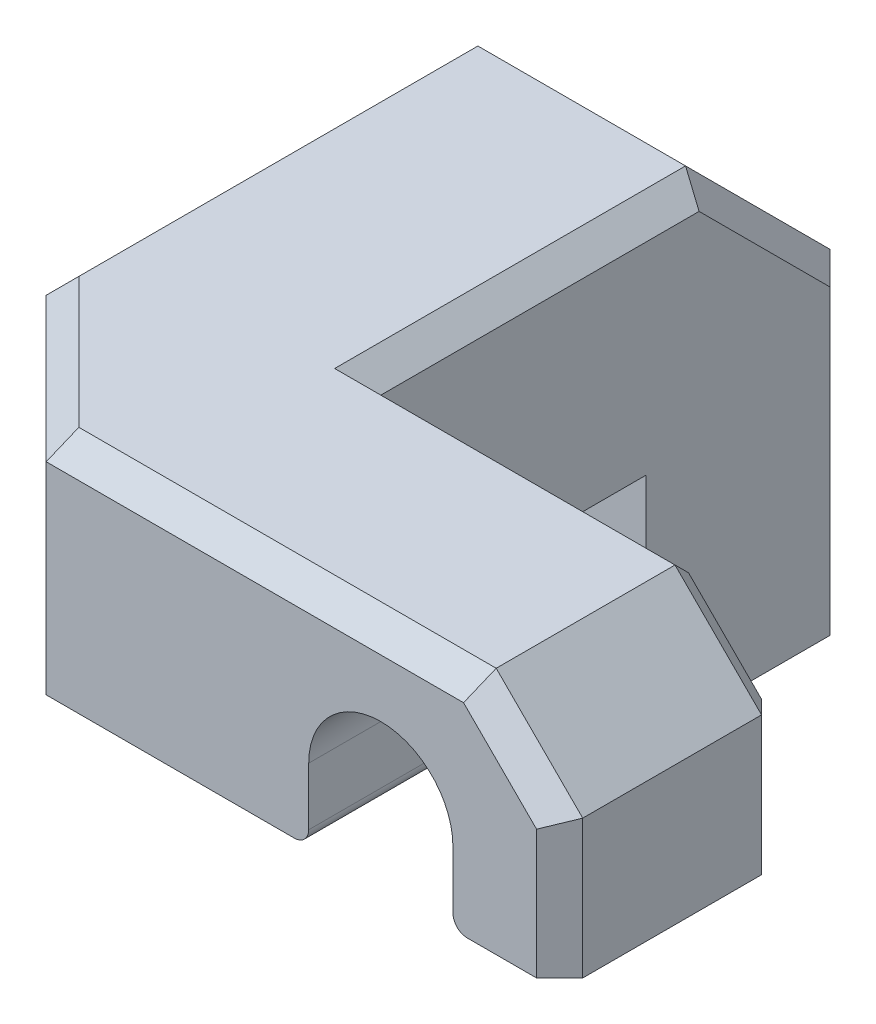
ISO-10303-21;
HEADER;
FILE_DESCRIPTION(('STEP AP214'),'2;1');
FILE_NAME('part.step','',(''),(''),'','','');
FILE_SCHEMA(('AUTOMOTIVE_DESIGN { 1 0 10303 214 1 1 1 1 }'));
ENDSEC;
DATA;
#1=APPLICATION_CONTEXT('core data for automotive mechanical design processes');
#2=APPLICATION_PROTOCOL_DEFINITION('international standard','automotive_design',2000,#1);
#3=PRODUCT_CONTEXT('',#1,'mechanical');
#4=PRODUCT('Part','Part','',(#3));
#5=PRODUCT_RELATED_PRODUCT_CATEGORY('part','',(#4));
#6=PRODUCT_DEFINITION_FORMATION('','',#4);
#7=PRODUCT_DEFINITION_CONTEXT('part definition',#1,'design');
#8=PRODUCT_DEFINITION('design','',#6,#7);
#9=PRODUCT_DEFINITION_SHAPE('','',#8);
#10=(LENGTH_UNIT() NAMED_UNIT(*) SI_UNIT(.MILLI.,.METRE.));
#11=(NAMED_UNIT(*) PLANE_ANGLE_UNIT() SI_UNIT($,.RADIAN.));
#12=(NAMED_UNIT(*) SI_UNIT($,.STERADIAN.) SOLID_ANGLE_UNIT());
#13=UNCERTAINTY_MEASURE_WITH_UNIT(LENGTH_MEASURE(1.E-05),#10,'distance_accuracy_value','');
#14=(GEOMETRIC_REPRESENTATION_CONTEXT(3) GLOBAL_UNCERTAINTY_ASSIGNED_CONTEXT((#13)) GLOBAL_UNIT_ASSIGNED_CONTEXT((#10,
#11,#12)) REPRESENTATION_CONTEXT('',''));
#15=CARTESIAN_POINT('',(0.,0.,0.));
#16=DIRECTION('',(0.,0.,1.));
#17=DIRECTION('',(1.,0.,0.));
#18=AXIS2_PLACEMENT_3D('',#15,#16,#17);
#19=CARTESIAN_POINT('',(5.588,5.5881,21.591));
#20=DIRECTION('',(0.,0.,-1.));
#21=DIRECTION('',(-1.,0.,0.));
#22=AXIS2_PLACEMENT_3D('',#19,#20,#21);
#23=CYLINDRICAL_SURFACE('',#22,1.778);
#24=CARTESIAN_POINT('',(5.588,5.5881,0.));
#25=DIRECTION('',(0.,0.,1.));
#26=DIRECTION('',(1.,0.,0.));
#27=AXIS2_PLACEMENT_3D('',#24,#25,#26);
#28=CIRCLE('',#27,1.778);
#29=CARTESIAN_POINT('',(7.366,5.5881,0.));
#30=VERTEX_POINT('',#29);
#31=EDGE_CURVE('E242',#30,#30,#28,.F.);
#32=ORIENTED_EDGE('',*,*,#31,.F.);
#33=EDGE_LOOP('',(#32));
#34=FACE_BOUND('',#33,.T.);
#35=CARTESIAN_POINT('',(5.588,5.5881,-5.54376957895253));
#36=DIRECTION('',(0.,0.,-1.));
#37=DIRECTION('',(-1.,0.,0.));
#38=AXIS2_PLACEMENT_3D('',#35,#36,#37);
#39=CIRCLE('',#38,1.778);
#40=CARTESIAN_POINT('',(3.81,5.5881,-5.54376957895253));
#41=VERTEX_POINT('',#40);
#42=EDGE_CURVE('E246',#41,#41,#39,.F.);
#43=ORIENTED_EDGE('',*,*,#42,.F.);
#44=EDGE_LOOP('',(#43));
#45=FACE_BOUND('',#44,.T.);
#46=ADVANCED_FACE('F37',(#34,#45),#23,.F.);
#47=CARTESIAN_POINT('',(11.176,0.,21.59));
#48=DIRECTION('',(0.,0.,1.));
#49=DIRECTION('',(1.,0.,0.));
#50=AXIS2_PLACEMENT_3D('',#47,#48,#49);
#51=PLANE('',#50);
#52=DIRECTION('',(-1.,0.,0.));
#53=VECTOR('',#52,1.);
#54=CARTESIAN_POINT('',(11.176,11.176,21.59));
#55=LINE('',#54,#53);
#56=CARTESIAN_POINT('',(27.94,11.176,21.59));
#57=VERTEX_POINT('',#56);
#58=CARTESIAN_POINT('',(24.892,11.176,21.59));
#59=VERTEX_POINT('',#58);
#60=EDGE_CURVE('E538',#57,#59,#55,.T.);
#61=ORIENTED_EDGE('',*,*,#60,.F.);
#62=DIRECTION('',(0.,1.,0.));
#63=VECTOR('',#62,1.);
#64=CARTESIAN_POINT('',(27.94,0.,21.59));
#65=LINE('',#64,#63);
#66=CARTESIAN_POINT('',(27.94,16.8511590206289,21.59));
#67=VERTEX_POINT('',#66);
#68=EDGE_CURVE('E333',#57,#67,#65,.T.);
#69=ORIENTED_EDGE('',*,*,#68,.T.);
#70=DIRECTION('',(-0.707106781186549,0.707106781186546,0.));
#71=VECTOR('',#70,1.);
#72=CARTESIAN_POINT('',(27.9835795103144,16.8075795103145,21.59));
#73=LINE('',#72,#71);
#74=CARTESIAN_POINT('',(24.7251590206289,20.066,21.59));
#75=VERTEX_POINT('',#74);
#76=EDGE_CURVE('E331',#67,#75,#73,.T.);
#77=ORIENTED_EDGE('',*,*,#76,.T.);
#78=DIRECTION('',(-1.,0.,0.));
#79=VECTOR('',#78,1.);
#80=CARTESIAN_POINT('',(11.176,20.066,21.59));
#81=LINE('',#80,#79);
#82=CARTESIAN_POINT('',(6.35000000000002,20.066,21.59));
#83=VERTEX_POINT('',#82);
#84=EDGE_CURVE('E326',#75,#83,#81,.T.);
#85=ORIENTED_EDGE('',*,*,#84,.T.);
#86=DIRECTION('',(0.,-1.,0.));
#87=VECTOR('',#86,1.);
#88=CARTESIAN_POINT('',(6.35000000000002,11.176,21.59));
#89=LINE('',#88,#87);
#90=CARTESIAN_POINT('',(6.35000000000002,11.176,21.59));
#91=VERTEX_POINT('',#90);
#92=EDGE_CURVE('E304',#83,#91,#89,.T.);
#93=ORIENTED_EDGE('',*,*,#92,.T.);
#94=CARTESIAN_POINT('',(17.272,11.176,21.59));
#95=VERTEX_POINT('',#94);
#96=EDGE_CURVE('E533',#95,#91,#55,.T.);
#97=ORIENTED_EDGE('',*,*,#96,.F.);
#98=CARTESIAN_POINT('',(17.272,11.811,21.59));
#99=DIRECTION('',(0.,0.,1.));
#100=DIRECTION('',(1.,0.,0.));
#101=AXIS2_PLACEMENT_3D('',#98,#99,#100);
#102=CIRCLE('',#101,0.635);
#103=CARTESIAN_POINT('',(17.907,11.811,21.59));
#104=VERTEX_POINT('',#103);
#105=EDGE_CURVE('E286',#95,#104,#102,.T.);
#106=ORIENTED_EDGE('',*,*,#105,.T.);
#107=DIRECTION('',(0.,-1.,0.));
#108=VECTOR('',#107,1.);
#109=CARTESIAN_POINT('',(17.907,0.,21.59));
#110=LINE('',#109,#108);
#111=CARTESIAN_POINT('',(17.907,14.351,21.59));
#112=VERTEX_POINT('',#111);
#113=EDGE_CURVE('E241',#112,#104,#110,.T.);
#114=ORIENTED_EDGE('',*,*,#113,.F.);
#115=CARTESIAN_POINT('',(21.082,14.351,21.59));
#116=DIRECTION('',(0.,0.,1.));
#117=DIRECTION('',(1.,0.,0.));
#118=AXIS2_PLACEMENT_3D('',#115,#116,#117);
#119=CIRCLE('',#118,3.175);
#120=CARTESIAN_POINT('',(24.257,14.351,21.59));
#121=VERTEX_POINT('',#120);
#122=EDGE_CURVE('E231',#112,#121,#119,.F.);
#123=ORIENTED_EDGE('',*,*,#122,.T.);
#124=DIRECTION('',(0.,-1.,0.));
#125=VECTOR('',#124,1.);
#126=CARTESIAN_POINT('',(24.257,0.,21.59));
#127=LINE('',#126,#125);
#128=CARTESIAN_POINT('',(24.257,11.811,21.59));
#129=VERTEX_POINT('',#128);
#130=EDGE_CURVE('E214',#121,#129,#127,.T.);
#131=ORIENTED_EDGE('',*,*,#130,.T.);
#132=CARTESIAN_POINT('',(24.892,11.811,21.59));
#133=DIRECTION('',(0.,0.,1.));
#134=DIRECTION('',(1.,0.,0.));
#135=AXIS2_PLACEMENT_3D('',#132,#133,#134);
#136=CIRCLE('',#135,0.635);
#137=EDGE_CURVE('E288',#129,#59,#136,.T.);
#138=ORIENTED_EDGE('',*,*,#137,.T.);
#139=EDGE_LOOP('',(#61,#69,#77,#85,#93,#97,#106,#114,#123,#131,#138));
#140=FACE_BOUND('',#139,.T.);
#141=ADVANCED_FACE('F239',(#140),#51,.T.);
#142=CARTESIAN_POINT('',(11.176,11.176,0.));
#143=DIRECTION('',(0.,-1.,0.));
#144=DIRECTION('',(0.,0.,-1.));
#145=AXIS2_PLACEMENT_3D('',#142,#143,#144);
#146=PLANE('',#145);
#147=ORIENTED_EDGE('',*,*,#96,.T.);
#148=DIRECTION('',(-0.707106781186549,0.,-0.707106781186546));
#149=VECTOR('',#148,1.);
#150=CARTESIAN_POINT('',(-2.03199999999998,11.176,13.208));
#151=LINE('',#150,#149);
#152=CARTESIAN_POINT('',(0.,11.176,15.24));
#153=VERTEX_POINT('',#152);
#154=EDGE_CURVE('E306',#91,#153,#151,.T.);
#155=ORIENTED_EDGE('',*,*,#154,.T.);
#156=DIRECTION('',(0.,0.,1.));
#157=VECTOR('',#156,1.);
#158=CARTESIAN_POINT('',(0.,11.176,0.));
#159=LINE('',#158,#157);
#160=CARTESIAN_POINT('',(0.,11.176,0.));
#161=VERTEX_POINT('',#160);
#162=EDGE_CURVE('E446',#161,#153,#159,.T.);
#163=ORIENTED_EDGE('',*,*,#162,.F.);
#164=DIRECTION('',(-1.,0.,0.));
#165=VECTOR('',#164,1.);
#166=CARTESIAN_POINT('',(11.176,11.176,0.));
#167=LINE('',#166,#165);
#168=CARTESIAN_POINT('',(11.176,11.176,0.));
#169=VERTEX_POINT('',#168);
#170=EDGE_CURVE('E529',#169,#161,#167,.T.);
#171=ORIENTED_EDGE('',*,*,#170,.F.);
#172=DIRECTION('',(0.,0.,1.));
#173=VECTOR('',#172,1.);
#174=CARTESIAN_POINT('',(11.176,11.176,0.));
#175=LINE('',#174,#173);
#176=CARTESIAN_POINT('',(11.176,11.176,11.684));
#177=VERTEX_POINT('',#176);
#178=EDGE_CURVE('E268',#169,#177,#175,.T.);
#179=ORIENTED_EDGE('',*,*,#178,.T.);
#180=DIRECTION('',(-1.,0.,0.));
#181=VECTOR('',#180,1.);
#182=CARTESIAN_POINT('',(28.956,11.176,11.684));
#183=LINE('',#182,#181);
#184=CARTESIAN_POINT('',(17.272,11.176,11.684));
#185=VERTEX_POINT('',#184);
#186=EDGE_CURVE('E259',#185,#177,#183,.T.);
#187=ORIENTED_EDGE('',*,*,#186,.F.);
#188=DIRECTION('',(0.,0.,-1.));
#189=VECTOR('',#188,1.);
#190=CARTESIAN_POINT('',(17.272,11.176,0.));
#191=LINE('',#190,#189);
#192=EDGE_CURVE('E293',#185,#95,#191,.F.);
#193=ORIENTED_EDGE('',*,*,#192,.T.);
#194=EDGE_LOOP('',(#147,#155,#163,#171,#179,#187,#193));
#195=FACE_BOUND('',#194,.T.);
#196=ADVANCED_FACE('F543',(#195),#146,.T.);
#197=CARTESIAN_POINT('',(28.956,21.082,11.684));
#198=DIRECTION('',(0.,0.,1.));
#199=DIRECTION('',(1.,0.,0.));
#200=AXIS2_PLACEMENT_3D('',#197,#198,#199);
#201=PLANE('',#200);
#202=DIRECTION('',(0.707106781186549,-0.707106781186546,0.));
#203=VECTOR('',#202,1.);
#204=CARTESIAN_POINT('',(28.2375795103145,16.5535795103145,11.684));
#205=LINE('',#204,#203);
#206=CARTESIAN_POINT('',(24.7251590206289,20.066,11.684));
#207=VERTEX_POINT('',#206);
#208=CARTESIAN_POINT('',(27.94,16.8511590206289,11.684));
#209=VERTEX_POINT('',#208);
#210=EDGE_CURVE('E349',#207,#209,#205,.T.);
#211=ORIENTED_EDGE('',*,*,#210,.T.);
#212=DIRECTION('',(0.,-1.,0.));
#213=VECTOR('',#212,1.);
#214=CARTESIAN_POINT('',(27.94,11.176,11.684));
#215=LINE('',#214,#213);
#216=CARTESIAN_POINT('',(27.94,11.176,11.684));
#217=VERTEX_POINT('',#216);
#218=EDGE_CURVE('E351',#209,#217,#215,.T.);
#219=ORIENTED_EDGE('',*,*,#218,.T.);
#220=CARTESIAN_POINT('',(24.892,11.176,11.684));
#221=VERTEX_POINT('',#220);
#222=EDGE_CURVE('E275',#217,#221,#183,.T.);
#223=ORIENTED_EDGE('',*,*,#222,.T.);
#224=CARTESIAN_POINT('',(24.892,11.811,11.684));
#225=DIRECTION('',(0.,0.,1.));
#226=DIRECTION('',(1.,0.,0.));
#227=AXIS2_PLACEMENT_3D('',#224,#225,#226);
#228=CIRCLE('',#227,0.635);
#229=CARTESIAN_POINT('',(24.257,11.811,11.684));
#230=VERTEX_POINT('',#229);
#231=EDGE_CURVE('E283',#221,#230,#228,.F.);
#232=ORIENTED_EDGE('',*,*,#231,.T.);
#233=DIRECTION('',(0.,-1.,0.));
#234=VECTOR('',#233,1.);
#235=CARTESIAN_POINT('',(24.257,0.,11.684));
#236=LINE('',#235,#234);
#237=CARTESIAN_POINT('',(24.257,14.351,11.684));
#238=VERTEX_POINT('',#237);
#239=EDGE_CURVE('E251',#238,#230,#236,.T.);
#240=ORIENTED_EDGE('',*,*,#239,.F.);
#241=CARTESIAN_POINT('',(21.082,14.351,11.684));
#242=DIRECTION('',(0.,0.,-1.));
#243=DIRECTION('',(-1.,0.,0.));
#244=AXIS2_PLACEMENT_3D('',#241,#242,#243);
#245=CIRCLE('',#244,3.175);
#246=CARTESIAN_POINT('',(17.907,14.351,11.684));
#247=VERTEX_POINT('',#246);
#248=EDGE_CURVE('E234',#247,#238,#245,.T.);
#249=ORIENTED_EDGE('',*,*,#248,.F.);
#250=DIRECTION('',(0.,-1.,0.));
#251=VECTOR('',#250,1.);
#252=CARTESIAN_POINT('',(17.907,0.,11.684));
#253=LINE('',#252,#251);
#254=CARTESIAN_POINT('',(17.907,11.811,11.684));
#255=VERTEX_POINT('',#254);
#256=EDGE_CURVE('E235',#247,#255,#253,.T.);
#257=ORIENTED_EDGE('',*,*,#256,.T.);
#258=CARTESIAN_POINT('',(17.272,11.811,11.684));
#259=DIRECTION('',(0.,0.,1.));
#260=DIRECTION('',(1.,0.,0.));
#261=AXIS2_PLACEMENT_3D('',#258,#259,#260);
#262=CIRCLE('',#261,0.635);
#263=EDGE_CURVE('E281',#255,#185,#262,.F.);
#264=ORIENTED_EDGE('',*,*,#263,.T.);
#265=ORIENTED_EDGE('',*,*,#186,.T.);
#266=DIRECTION('',(0.,1.,0.));
#267=VECTOR('',#266,1.);
#268=CARTESIAN_POINT('',(11.176,21.082,11.684));
#269=LINE('',#268,#267);
#270=CARTESIAN_POINT('',(11.176,20.066,11.684));
#271=VERTEX_POINT('',#270);
#272=EDGE_CURVE('E226',#177,#271,#269,.T.);
#273=ORIENTED_EDGE('',*,*,#272,.T.);
#274=DIRECTION('',(1.,0.,0.));
#275=VECTOR('',#274,1.);
#276=CARTESIAN_POINT('',(25.146,20.066,11.684));
#277=LINE('',#276,#275);
#278=EDGE_CURVE('E347',#271,#207,#277,.T.);
#279=ORIENTED_EDGE('',*,*,#278,.T.);
#280=EDGE_LOOP('',(#211,#219,#223,#232,#240,#249,#257,#264,#265,#273,#279));
#281=FACE_BOUND('',#280,.T.);
#282=ADVANCED_FACE('F554',(#281),#201,.F.);
#283=CARTESIAN_POINT('',(11.176,21.082,0.));
#284=DIRECTION('',(0.,1.,0.));
#285=DIRECTION('',(0.,0.,1.));
#286=AXIS2_PLACEMENT_3D('',#283,#284,#285);
#287=PLANE('',#286);
#288=DIRECTION('',(0.,0.,1.));
#289=VECTOR('',#288,1.);
#290=CARTESIAN_POINT('',(1.016,21.082,15.24));
#291=LINE('',#290,#289);
#292=CARTESIAN_POINT('',(1.016,21.082,-2.74976957895253));
#293=VERTEX_POINT('',#292);
#294=CARTESIAN_POINT('',(1.016,21.082,14.8191590206289));
#295=VERTEX_POINT('',#294);
#296=EDGE_CURVE('E339',#293,#295,#291,.T.);
#297=ORIENTED_EDGE('',*,*,#296,.T.);
#298=DIRECTION('',(0.707106781186549,0.,0.707106781186546));
#299=VECTOR('',#298,1.);
#300=CARTESIAN_POINT('',(-1.31357951031446,21.082,12.4895795103145));
#301=LINE('',#300,#299);
#302=CARTESIAN_POINT('',(6.77084097937106,21.082,20.574));
#303=VERTEX_POINT('',#302);
#304=EDGE_CURVE('E389',#295,#303,#301,.T.);
#305=ORIENTED_EDGE('',*,*,#304,.T.);
#306=DIRECTION('',(1.,0.,0.));
#307=VECTOR('',#306,1.);
#308=CARTESIAN_POINT('',(11.176,21.082,20.574));
#309=LINE('',#308,#307);
#310=CARTESIAN_POINT('',(25.146,21.082,20.574));
#311=VERTEX_POINT('',#310);
#312=EDGE_CURVE('E345',#303,#311,#309,.T.);
#313=ORIENTED_EDGE('',*,*,#312,.T.);
#314=DIRECTION('',(0.,0.,-1.));
#315=VECTOR('',#314,1.);
#316=CARTESIAN_POINT('',(25.146,21.082,0.));
#317=LINE('',#316,#315);
#318=CARTESIAN_POINT('',(25.146,21.082,12.7));
#319=VERTEX_POINT('',#318);
#320=EDGE_CURVE('E311',#311,#319,#317,.T.);
#321=ORIENTED_EDGE('',*,*,#320,.T.);
#322=DIRECTION('',(-1.,0.,0.));
#323=VECTOR('',#322,1.);
#324=CARTESIAN_POINT('',(11.176,21.082,12.7));
#325=LINE('',#324,#323);
#326=CARTESIAN_POINT('',(10.16,21.082,12.7));
#327=VERTEX_POINT('',#326);
#328=EDGE_CURVE('E343',#319,#327,#325,.T.);
#329=ORIENTED_EDGE('',*,*,#328,.T.);
#330=DIRECTION('',(0.,0.,-1.));
#331=VECTOR('',#330,1.);
#332=CARTESIAN_POINT('',(10.16,21.082,0.));
#333=LINE('',#332,#331);
#334=CARTESIAN_POINT('',(10.16,21.082,-2.74976957895253));
#335=VERTEX_POINT('',#334);
#336=EDGE_CURVE('E341',#327,#335,#333,.T.);
#337=ORIENTED_EDGE('',*,*,#336,.T.);
#338=DIRECTION('',(-1.,0.,0.));
#339=VECTOR('',#338,1.);
#340=CARTESIAN_POINT('',(0.,21.082,-2.74976957895253));
#341=LINE('',#340,#339);
#342=EDGE_CURVE('E295',#335,#293,#341,.T.);
#343=ORIENTED_EDGE('',*,*,#342,.T.);
#344=EDGE_LOOP('',(#297,#305,#313,#321,#329,#337,#343));
#345=FACE_BOUND('',#344,.T.);
#346=ADVANCED_FACE('F451',(#345),#287,.T.);
#347=DIRECTION('',(0.,0.,-1.));
#348=VECTOR('',#347,1.);
#349=CARTESIAN_POINT('',(28.956,11.176,21.59));
#350=LINE('',#349,#348);
#351=CARTESIAN_POINT('',(28.956,11.176,20.574));
#352=VERTEX_POINT('',#351);
#353=CARTESIAN_POINT('',(28.956,11.176,12.7));
#354=VERTEX_POINT('',#353);
#355=EDGE_CURVE('E256',#352,#354,#350,.T.);
#356=ORIENTED_EDGE('',*,*,#355,.F.);
#357=DIRECTION('',(0.707106781186545,0.,-0.70710678118655));
#358=VECTOR('',#357,1.);
#359=CARTESIAN_POINT('',(30.3530000000001,11.176,19.1769999999999));
#360=LINE('',#359,#358);
#361=EDGE_CURVE('E322',#352,#57,#360,.F.);
#362=ORIENTED_EDGE('',*,*,#361,.T.);
#363=ORIENTED_EDGE('',*,*,#60,.T.);
#364=DIRECTION('',(0.,0.,-1.));
#365=VECTOR('',#364,1.);
#366=CARTESIAN_POINT('',(24.892,11.176,11.684));
#367=LINE('',#366,#365);
#368=EDGE_CURVE('E280',#59,#221,#367,.T.);
#369=ORIENTED_EDGE('',*,*,#368,.T.);
#370=ORIENTED_EDGE('',*,*,#222,.F.);
#371=DIRECTION('',(0.707106781186548,0.,0.707106781186548));
#372=VECTOR('',#371,1.);
#373=CARTESIAN_POINT('',(13.716,11.176,-2.54));
#374=LINE('',#373,#372);
#375=EDGE_CURVE('E318',#217,#354,#374,.T.);
#376=ORIENTED_EDGE('',*,*,#375,.T.);
#377=EDGE_LOOP('',(#356,#362,#363,#369,#370,#376));
#378=FACE_BOUND('',#377,.T.);
#379=ADVANCED_FACE('F562',(#378),#146,.T.);
#380=CARTESIAN_POINT('',(11.176,0.,0.));
#381=DIRECTION('',(0.,0.,1.));
#382=DIRECTION('',(1.,0.,0.));
#383=AXIS2_PLACEMENT_3D('',#380,#381,#382);
#384=PLANE('',#383);
#385=ORIENTED_EDGE('',*,*,#31,.T.);
#386=EDGE_LOOP('',(#385));
#387=FACE_BOUND('',#386,.T.);
#388=DIRECTION('',(0.,1.,0.));
#389=VECTOR('',#388,1.);
#390=CARTESIAN_POINT('',(0.,0.,0.));
#391=LINE('',#390,#389);
#392=CARTESIAN_POINT('',(0.,1.0161,0.));
#393=VERTEX_POINT('',#392);
#394=EDGE_CURVE('E536',#393,#161,#391,.T.);
#395=ORIENTED_EDGE('',*,*,#394,.F.);
#396=DIRECTION('',(-0.707106781186548,0.707106781186548,0.));
#397=VECTOR('',#396,1.);
#398=CARTESIAN_POINT('',(6.09605,-5.07995,0.));
#399=LINE('',#398,#397);
#400=CARTESIAN_POINT('',(1.016,9.99999999997031E-05,0.));
#401=VERTEX_POINT('',#400);
#402=EDGE_CURVE('E387',#393,#401,#399,.F.);
#403=ORIENTED_EDGE('',*,*,#402,.T.);
#404=DIRECTION('',(-1.,0.,0.));
#405=VECTOR('',#404,1.);
#406=CARTESIAN_POINT('',(11.176,0.0001,0.));
#407=LINE('',#406,#405);
#408=CARTESIAN_POINT('',(10.16,9.99999999998657E-05,0.));
#409=VERTEX_POINT('',#408);
#410=EDGE_CURVE('E522',#409,#401,#407,.T.);
#411=ORIENTED_EDGE('',*,*,#410,.F.);
#412=DIRECTION('',(0.707106781186548,0.707106781186548,0.));
#413=VECTOR('',#412,1.);
#414=CARTESIAN_POINT('',(10.66795,0.508049999999998,0.));
#415=LINE('',#414,#413);
#416=CARTESIAN_POINT('',(11.176,1.0161,0.));
#417=VERTEX_POINT('',#416);
#418=EDGE_CURVE('E385',#409,#417,#415,.T.);
#419=ORIENTED_EDGE('',*,*,#418,.T.);
#420=DIRECTION('',(0.,1.,0.));
#421=VECTOR('',#420,1.);
#422=CARTESIAN_POINT('',(11.176,0.,0.));
#423=LINE('',#422,#421);
#424=EDGE_CURVE('E530',#417,#169,#423,.T.);
#425=ORIENTED_EDGE('',*,*,#424,.T.);
#426=ORIENTED_EDGE('',*,*,#170,.T.);
#427=EDGE_LOOP('',(#395,#403,#411,#419,#425,#426));
#428=FACE_BOUND('',#427,.T.);
#429=ADVANCED_FACE('F526',(#387,#428),#384,.T.);
#430=CARTESIAN_POINT('',(11.176,0.0001,0.));
#431=DIRECTION('',(0.,1.,0.));
#432=DIRECTION('',(0.,0.,1.));
#433=AXIS2_PLACEMENT_3D('',#430,#431,#432);
#434=PLANE('',#433);
#435=ORIENTED_EDGE('',*,*,#410,.T.);
#436=DIRECTION('',(0.,0.,-1.));
#437=VECTOR('',#436,1.);
#438=CARTESIAN_POINT('',(1.016,0.0001,0.));
#439=LINE('',#438,#437);
#440=CARTESIAN_POINT('',(1.016,0.0001,-8.08376957895254));
#441=VERTEX_POINT('',#440);
#442=EDGE_CURVE('E383',#401,#441,#439,.T.);
#443=ORIENTED_EDGE('',*,*,#442,.T.);
#444=DIRECTION('',(1.,0.,0.));
#445=VECTOR('',#444,1.);
#446=CARTESIAN_POINT('',(11.176,0.0001,-8.08376957895254));
#447=LINE('',#446,#445);
#448=CARTESIAN_POINT('',(10.16,0.0001,-8.08376957895254));
#449=VERTEX_POINT('',#448);
#450=EDGE_CURVE('E381',#441,#449,#447,.T.);
#451=ORIENTED_EDGE('',*,*,#450,.T.);
#452=DIRECTION('',(0.,0.,1.));
#453=VECTOR('',#452,1.);
#454=CARTESIAN_POINT('',(10.16,0.0001,0.));
#455=LINE('',#454,#453);
#456=EDGE_CURVE('E379',#449,#409,#455,.T.);
#457=ORIENTED_EDGE('',*,*,#456,.T.);
#458=EDGE_LOOP('',(#435,#443,#451,#457));
#459=FACE_BOUND('',#458,.T.);
#460=ADVANCED_FACE('F521',(#459),#434,.F.);
#461=CARTESIAN_POINT('',(11.176,0.,-9.09976957895253));
#462=DIRECTION('',(0.,0.,1.));
#463=DIRECTION('',(1.,0.,0.));
#464=AXIS2_PLACEMENT_3D('',#461,#462,#463);
#465=PLANE('',#464);
#466=CARTESIAN_POINT('',(5.588,5.5881,-9.09976957895253));
#467=DIRECTION('',(0.,0.,-1.));
#468=DIRECTION('',(-1.,0.,0.));
#469=AXIS2_PLACEMENT_3D('',#466,#467,#468);
#470=CIRCLE('',#469,2.921);
#471=CARTESIAN_POINT('',(2.667,5.5881,-9.09976957895253));
#472=VERTEX_POINT('',#471);
#473=EDGE_CURVE('E397',#472,#472,#470,.T.);
#474=ORIENTED_EDGE('',*,*,#473,.F.);
#475=EDGE_LOOP('',(#474));
#476=FACE_BOUND('',#475,.T.);
#477=DIRECTION('',(-1.,0.,0.));
#478=VECTOR('',#477,1.);
#479=CARTESIAN_POINT('',(11.176,1.0161,-9.09976957895253));
#480=LINE('',#479,#478);
#481=CARTESIAN_POINT('',(10.16,1.0161,-9.09976957895253));
#482=VERTEX_POINT('',#481);
#483=CARTESIAN_POINT('',(1.016,1.0161,-9.09976957895253));
#484=VERTEX_POINT('',#483);
#485=EDGE_CURVE('E373',#482,#484,#480,.T.);
#486=ORIENTED_EDGE('',*,*,#485,.T.);
#487=DIRECTION('',(0.,1.,0.));
#488=VECTOR('',#487,1.);
#489=CARTESIAN_POINT('',(1.016,0.,-9.09976957895253));
#490=LINE('',#489,#488);
#491=CARTESIAN_POINT('',(1.016,14.732,-9.09976957895253));
#492=VERTEX_POINT('',#491);
#493=EDGE_CURVE('E377',#484,#492,#490,.T.);
#494=ORIENTED_EDGE('',*,*,#493,.T.);
#495=DIRECTION('',(1.,0.,0.));
#496=VECTOR('',#495,1.);
#497=CARTESIAN_POINT('',(11.176,14.732,-9.09976957895253));
#498=LINE('',#497,#496);
#499=CARTESIAN_POINT('',(10.16,14.732,-9.09976957895253));
#500=VERTEX_POINT('',#499);
#501=EDGE_CURVE('E298',#492,#500,#498,.T.);
#502=ORIENTED_EDGE('',*,*,#501,.T.);
#503=DIRECTION('',(0.,-1.,0.));
#504=VECTOR('',#503,1.);
#505=CARTESIAN_POINT('',(10.16,0.0001,-9.09976957895253));
#506=LINE('',#505,#504);
#507=EDGE_CURVE('E375',#500,#482,#506,.T.);
#508=ORIENTED_EDGE('',*,*,#507,.T.);
#509=EDGE_LOOP('',(#486,#494,#502,#508));
#510=FACE_BOUND('',#509,.T.);
#511=ADVANCED_FACE('F503',(#476,#510),#465,.F.);
#512=CARTESIAN_POINT('',(11.176,0.,0.));
#513=DIRECTION('',(1.,0.,0.));
#514=DIRECTION('',(0.,0.,-1.));
#515=AXIS2_PLACEMENT_3D('',#512,#513,#514);
#516=PLANE('',#515);
#517=DIRECTION('',(0.,0.707106781186549,0.707106781186546));
#518=VECTOR('',#517,1.);
#519=CARTESIAN_POINT('',(11.176,11.1974642997907,-11.1974642997907));
#520=LINE('',#519,#518);
#521=CARTESIAN_POINT('',(11.176,14.3111590206289,-8.08376957895254));
#522=VERTEX_POINT('',#521);
#523=CARTESIAN_POINT('',(11.176,20.066,-2.32892859958147));
#524=VERTEX_POINT('',#523);
#525=EDGE_CURVE('E357',#522,#524,#520,.T.);
#526=ORIENTED_EDGE('',*,*,#525,.T.);
#527=DIRECTION('',(0.,0.,1.));
#528=VECTOR('',#527,1.);
#529=CARTESIAN_POINT('',(11.176,20.066,0.));
#530=LINE('',#529,#528);
#531=EDGE_CURVE('E359',#524,#271,#530,.T.);
#532=ORIENTED_EDGE('',*,*,#531,.T.);
#533=ORIENTED_EDGE('',*,*,#272,.F.);
#534=ORIENTED_EDGE('',*,*,#178,.F.);
#535=ORIENTED_EDGE('',*,*,#424,.F.);
#536=DIRECTION('',(0.,0.,-1.));
#537=VECTOR('',#536,1.);
#538=CARTESIAN_POINT('',(11.176,1.0161,-9.09976957895253));
#539=LINE('',#538,#537);
#540=CARTESIAN_POINT('',(11.176,1.0161,-8.08376957895254));
#541=VERTEX_POINT('',#540);
#542=EDGE_CURVE('E353',#417,#541,#539,.T.);
#543=ORIENTED_EDGE('',*,*,#542,.T.);
#544=DIRECTION('',(0.,1.,0.));
#545=VECTOR('',#544,1.);
#546=CARTESIAN_POINT('',(11.176,14.732,-8.08376957895254));
#547=LINE('',#546,#545);
#548=EDGE_CURVE('E355',#541,#522,#547,.T.);
#549=ORIENTED_EDGE('',*,*,#548,.T.);
#550=EDGE_LOOP('',(#526,#532,#533,#534,#535,#543,#549));
#551=FACE_BOUND('',#550,.T.);
#552=ADVANCED_FACE('F597',(#551),#516,.T.);
#553=CARTESIAN_POINT('',(0.,0.,0.));
#554=DIRECTION('',(1.,0.,0.));
#555=DIRECTION('',(0.,0.,-1.));
#556=AXIS2_PLACEMENT_3D('',#553,#554,#555);
#557=PLANE('',#556);
#558=DIRECTION('',(0.,1.,0.));
#559=VECTOR('',#558,1.);
#560=CARTESIAN_POINT('',(0.,21.082,15.24));
#561=LINE('',#560,#559);
#562=CARTESIAN_POINT('',(0.,20.066,15.24));
#563=VERTEX_POINT('',#562);
#564=EDGE_CURVE('E301',#153,#563,#561,.T.);
#565=ORIENTED_EDGE('',*,*,#564,.T.);
#566=DIRECTION('',(0.,0.,-1.));
#567=VECTOR('',#566,1.);
#568=CARTESIAN_POINT('',(0.,20.066,-2.74976957895253));
#569=LINE('',#568,#567);
#570=CARTESIAN_POINT('',(0.,20.066,-2.32892859958147));
#571=VERTEX_POINT('',#570);
#572=EDGE_CURVE('E371',#563,#571,#569,.T.);
#573=ORIENTED_EDGE('',*,*,#572,.T.);
#574=DIRECTION('',(0.,-0.707106781186549,-0.707106781186546));
#575=VECTOR('',#574,1.);
#576=CARTESIAN_POINT('',(0.,14.0135795103144,-8.381349089267));
#577=LINE('',#576,#575);
#578=CARTESIAN_POINT('',(0.,14.3111590206289,-8.08376957895254));
#579=VERTEX_POINT('',#578);
#580=EDGE_CURVE('E369',#571,#579,#577,.T.);
#581=ORIENTED_EDGE('',*,*,#580,.T.);
#582=DIRECTION('',(0.,-1.,0.));
#583=VECTOR('',#582,1.);
#584=CARTESIAN_POINT('',(0.,0.,-8.08376957895254));
#585=LINE('',#584,#583);
#586=CARTESIAN_POINT('',(0.,1.0161,-8.08376957895254));
#587=VERTEX_POINT('',#586);
#588=EDGE_CURVE('E367',#579,#587,#585,.T.);
#589=ORIENTED_EDGE('',*,*,#588,.T.);
#590=DIRECTION('',(0.,0.,1.));
#591=VECTOR('',#590,1.);
#592=CARTESIAN_POINT('',(0.,1.0161,0.));
#593=LINE('',#592,#591);
#594=EDGE_CURVE('E365',#587,#393,#593,.T.);
#595=ORIENTED_EDGE('',*,*,#594,.T.);
#596=ORIENTED_EDGE('',*,*,#394,.T.);
#597=ORIENTED_EDGE('',*,*,#162,.T.);
#598=EDGE_LOOP('',(#565,#573,#581,#589,#595,#596,#597));
#599=FACE_BOUND('',#598,.T.);
#600=ADVANCED_FACE('F443',(#599),#557,.F.);
#601=CARTESIAN_POINT('',(28.956,0.,0.));
#602=DIRECTION('',(1.,0.,0.));
#603=DIRECTION('',(0.,0.,-1.));
#604=AXIS2_PLACEMENT_3D('',#601,#602,#603);
#605=PLANE('',#604);
#606=DIRECTION('',(0.,0.,1.));
#607=VECTOR('',#606,1.);
#608=CARTESIAN_POINT('',(28.956,17.272,0.));
#609=LINE('',#608,#607);
#610=CARTESIAN_POINT('',(28.956,17.272,12.7));
#611=VERTEX_POINT('',#610);
#612=CARTESIAN_POINT('',(28.956,17.272,20.574));
#613=VERTEX_POINT('',#612);
#614=EDGE_CURVE('E308',#611,#613,#609,.T.);
#615=ORIENTED_EDGE('',*,*,#614,.T.);
#616=DIRECTION('',(0.,-1.,0.));
#617=VECTOR('',#616,1.);
#618=CARTESIAN_POINT('',(28.956,0.,20.574));
#619=LINE('',#618,#617);
#620=EDGE_CURVE('E316',#613,#352,#619,.T.);
#621=ORIENTED_EDGE('',*,*,#620,.T.);
#622=ORIENTED_EDGE('',*,*,#355,.T.);
#623=DIRECTION('',(0.,1.,0.));
#624=VECTOR('',#623,1.);
#625=CARTESIAN_POINT('',(28.956,17.272,12.7));
#626=LINE('',#625,#624);
#627=EDGE_CURVE('E314',#354,#611,#626,.T.);
#628=ORIENTED_EDGE('',*,*,#627,.T.);
#629=EDGE_LOOP('',(#615,#621,#622,#628));
#630=FACE_BOUND('',#629,.T.);
#631=ADVANCED_FACE('F465',(#630),#605,.T.);
#632=CARTESIAN_POINT('',(21.082,14.351,21.591));
#633=DIRECTION('',(0.,0.,-1.));
#634=DIRECTION('',(-1.,0.,0.));
#635=AXIS2_PLACEMENT_3D('',#632,#633,#634);
#636=CYLINDRICAL_SURFACE('',#635,3.175);
#637=DIRECTION('',(0.,0.,-1.));
#638=VECTOR('',#637,1.);
#639=CARTESIAN_POINT('',(17.907,14.351,21.591));
#640=LINE('',#639,#638);
#641=EDGE_CURVE('E227',#112,#247,#640,.T.);
#642=ORIENTED_EDGE('',*,*,#641,.T.);
#643=ORIENTED_EDGE('',*,*,#248,.T.);
#644=DIRECTION('',(0.,0.,-1.));
#645=VECTOR('',#644,1.);
#646=CARTESIAN_POINT('',(24.257,14.351,21.591));
#647=LINE('',#646,#645);
#648=EDGE_CURVE('E218',#121,#238,#647,.T.);
#649=ORIENTED_EDGE('',*,*,#648,.F.);
#650=ORIENTED_EDGE('',*,*,#122,.F.);
#651=EDGE_LOOP('',(#642,#643,#649,#650));
#652=FACE_BOUND('',#651,.T.);
#653=ADVANCED_FACE('F230',(#652),#636,.F.);
#654=CARTESIAN_POINT('',(17.907,0.,21.591));
#655=DIRECTION('',(1.,0.,0.));
#656=DIRECTION('',(0.,0.,-1.));
#657=AXIS2_PLACEMENT_3D('',#654,#655,#656);
#658=PLANE('',#657);
#659=ORIENTED_EDGE('',*,*,#113,.T.);
#660=DIRECTION('',(0.,0.,-1.));
#661=VECTOR('',#660,1.);
#662=CARTESIAN_POINT('',(17.907,11.811,21.591));
#663=LINE('',#662,#661);
#664=EDGE_CURVE('E290',#104,#255,#663,.T.);
#665=ORIENTED_EDGE('',*,*,#664,.T.);
#666=ORIENTED_EDGE('',*,*,#256,.F.);
#667=ORIENTED_EDGE('',*,*,#641,.F.);
#668=EDGE_LOOP('',(#659,#665,#666,#667));
#669=FACE_BOUND('',#668,.T.);
#670=ADVANCED_FACE('F552',(#669),#658,.T.);
#671=CARTESIAN_POINT('',(24.257,0.,21.591));
#672=DIRECTION('',(1.,0.,0.));
#673=DIRECTION('',(0.,0.,-1.));
#674=AXIS2_PLACEMENT_3D('',#671,#672,#673);
#675=PLANE('',#674);
#676=ORIENTED_EDGE('',*,*,#239,.T.);
#677=DIRECTION('',(0.,0.,-1.));
#678=VECTOR('',#677,1.);
#679=CARTESIAN_POINT('',(24.257,11.811,21.59));
#680=LINE('',#679,#678);
#681=EDGE_CURVE('E221',#230,#129,#680,.F.);
#682=ORIENTED_EDGE('',*,*,#681,.T.);
#683=ORIENTED_EDGE('',*,*,#130,.F.);
#684=ORIENTED_EDGE('',*,*,#648,.T.);
#685=EDGE_LOOP('',(#676,#682,#683,#684));
#686=FACE_BOUND('',#685,.T.);
#687=ADVANCED_FACE('F217',(#686),#675,.F.);
#688=CARTESIAN_POINT('',(5.588,5.5881,-5.54376957895253));
#689=DIRECTION('',(0.,0.,-1.));
#690=DIRECTION('',(-1.,0.,0.));
#691=AXIS2_PLACEMENT_3D('',#688,#689,#690);
#692=PLANE('',#691);
#693=CARTESIAN_POINT('',(5.588,5.5881,-5.54376957895253));
#694=DIRECTION('',(0.,0.,-1.));
#695=DIRECTION('',(-1.,0.,0.));
#696=AXIS2_PLACEMENT_3D('',#693,#694,#695);
#697=CIRCLE('',#696,2.921);
#698=CARTESIAN_POINT('',(2.667,5.5881,-5.54376957895253));
#699=VERTEX_POINT('',#698);
#700=EDGE_CURVE('E926',#699,#699,#697,.T.);
#701=ORIENTED_EDGE('',*,*,#700,.T.);
#702=EDGE_LOOP('',(#701));
#703=FACE_BOUND('',#702,.T.);
#704=ORIENTED_EDGE('',*,*,#42,.T.);
#705=EDGE_LOOP('',(#704));
#706=FACE_BOUND('',#705,.T.);
#707=ADVANCED_FACE('F590',(#703,#706),#692,.T.);
#708=CARTESIAN_POINT('',(5.588,5.5881,-5.54376957895253));
#709=DIRECTION('',(0.,0.,-1.));
#710=DIRECTION('',(-1.,0.,0.));
#711=AXIS2_PLACEMENT_3D('',#708,#709,#710);
#712=CYLINDRICAL_SURFACE('',#711,2.921);
#713=ORIENTED_EDGE('',*,*,#700,.F.);
#714=EDGE_LOOP('',(#713));
#715=FACE_BOUND('',#714,.T.);
#716=ORIENTED_EDGE('',*,*,#473,.T.);
#717=EDGE_LOOP('',(#716));
#718=FACE_BOUND('',#717,.T.);
#719=ADVANCED_FACE('F584',(#715,#718),#712,.F.);
#720=CARTESIAN_POINT('',(24.892,11.811,0.));
#721=DIRECTION('',(0.,0.,1.));
#722=DIRECTION('',(0.,-1.,0.));
#723=AXIS2_PLACEMENT_3D('',#720,#721,#722);
#724=CYLINDRICAL_SURFACE('',#723,0.635);
#725=ORIENTED_EDGE('',*,*,#137,.F.);
#726=ORIENTED_EDGE('',*,*,#681,.F.);
#727=ORIENTED_EDGE('',*,*,#231,.F.);
#728=ORIENTED_EDGE('',*,*,#368,.F.);
#729=EDGE_LOOP('',(#725,#726,#727,#728));
#730=FACE_BOUND('',#729,.T.);
#731=ADVANCED_FACE('F557',(#730),#724,.T.);
#732=CARTESIAN_POINT('',(17.272,11.811,21.591));
#733=DIRECTION('',(0.,0.,-1.));
#734=DIRECTION('',(0.,1.,0.));
#735=AXIS2_PLACEMENT_3D('',#732,#733,#734);
#736=CYLINDRICAL_SURFACE('',#735,0.635);
#737=ORIENTED_EDGE('',*,*,#105,.F.);
#738=ORIENTED_EDGE('',*,*,#192,.F.);
#739=ORIENTED_EDGE('',*,*,#263,.F.);
#740=ORIENTED_EDGE('',*,*,#664,.F.);
#741=EDGE_LOOP('',(#737,#738,#739,#740));
#742=FACE_BOUND('',#741,.T.);
#743=ADVANCED_FACE('F549',(#742),#736,.T.);
#744=CARTESIAN_POINT('',(11.176,21.082,-2.74976957895253));
#745=DIRECTION('',(0.,0.707106781186546,-0.707106781186549));
#746=DIRECTION('',(1.,0.,0.));
#747=AXIS2_PLACEMENT_3D('',#744,#745,#746);
#748=PLANE('',#747);
#749=ORIENTED_EDGE('',*,*,#342,.F.);
#750=DIRECTION('',(0.,-0.707106781186549,-0.707106781186546));
#751=VECTOR('',#750,1.);
#752=CARTESIAN_POINT('',(10.16,21.082,-2.74976957895253));
#753=LINE('',#752,#751);
#754=EDGE_CURVE('E363',#335,#500,#753,.T.);
#755=ORIENTED_EDGE('',*,*,#754,.T.);
#756=ORIENTED_EDGE('',*,*,#501,.F.);
#757=DIRECTION('',(0.,0.707106781186549,0.707106781186546));
#758=VECTOR('',#757,1.);
#759=CARTESIAN_POINT('',(1.016,21.082,-2.74976957895253));
#760=LINE('',#759,#758);
#761=EDGE_CURVE('E361',#492,#293,#760,.T.);
#762=ORIENTED_EDGE('',*,*,#761,.T.);
#763=EDGE_LOOP('',(#749,#755,#756,#762));
#764=FACE_BOUND('',#763,.T.);
#765=ADVANCED_FACE('F489',(#764),#748,.T.);
#766=CARTESIAN_POINT('',(0.,0.,15.24));
#767=DIRECTION('',(-0.707106781186546,0.,0.707106781186549));
#768=DIRECTION('',(0.,-1.,0.));
#769=AXIS2_PLACEMENT_3D('',#766,#767,#768);
#770=PLANE('',#769);
#771=ORIENTED_EDGE('',*,*,#92,.F.);
#772=DIRECTION('',(-0.707106781186549,0.,-0.707106781186546));
#773=VECTOR('',#772,1.);
#774=CARTESIAN_POINT('',(0.,20.066,15.24));
#775=LINE('',#774,#773);
#776=EDGE_CURVE('E45',#83,#563,#775,.T.);
#777=ORIENTED_EDGE('',*,*,#776,.T.);
#778=ORIENTED_EDGE('',*,*,#564,.F.);
#779=ORIENTED_EDGE('',*,*,#154,.F.);
#780=EDGE_LOOP('',(#771,#777,#778,#779));
#781=FACE_BOUND('',#780,.T.);
#782=ADVANCED_FACE('F439',(#781),#770,.T.);
#783=CARTESIAN_POINT('',(28.956,17.272,0.));
#784=DIRECTION('',(-0.707106781186546,-0.707106781186549,0.));
#785=DIRECTION('',(0.,0.,1.));
#786=AXIS2_PLACEMENT_3D('',#783,#784,#785);
#787=PLANE('',#786);
#788=ORIENTED_EDGE('',*,*,#320,.F.);
#789=DIRECTION('',(-0.707106781186549,0.707106781186546,0.));
#790=VECTOR('',#789,1.);
#791=CARTESIAN_POINT('',(28.956,17.272,20.574));
#792=LINE('',#791,#790);
#793=EDGE_CURVE('E337',#311,#613,#792,.F.);
#794=ORIENTED_EDGE('',*,*,#793,.T.);
#795=ORIENTED_EDGE('',*,*,#614,.F.);
#796=DIRECTION('',(0.707106781186549,-0.707106781186546,0.));
#797=VECTOR('',#796,1.);
#798=CARTESIAN_POINT('',(25.146,21.082,12.7));
#799=LINE('',#798,#797);
#800=EDGE_CURVE('E335',#611,#319,#799,.F.);
#801=ORIENTED_EDGE('',*,*,#800,.T.);
#802=EDGE_LOOP('',(#788,#794,#795,#801));
#803=FACE_BOUND('',#802,.T.);
#804=ADVANCED_FACE('F464',(#803),#787,.F.);
#805=CARTESIAN_POINT('',(11.176,20.066,21.59));
#806=DIRECTION('',(0.,-0.70710678118655,-0.707106781186545));
#807=DIRECTION('',(-1.,0.,0.));
#808=AXIS2_PLACEMENT_3D('',#805,#806,#807);
#809=PLANE('',#808);
#810=ORIENTED_EDGE('',*,*,#312,.F.);
#811=DIRECTION('',(-0.281084637714808,-0.678598344545847,0.678598344545852));
#812=VECTOR('',#811,1.);
#813=CARTESIAN_POINT('',(6.73129537599702,20.9865284680022,20.6694715319978));
#814=LINE('',#813,#812);
#815=EDGE_CURVE('E58',#303,#83,#814,.T.);
#816=ORIENTED_EDGE('',*,*,#815,.T.);
#817=ORIENTED_EDGE('',*,*,#84,.F.);
#818=DIRECTION('',(-0.281084637714818,-0.678598344545845,0.67859834454585));
#819=VECTOR('',#818,1.);
#820=CARTESIAN_POINT('',(23.6546592934813,17.4815850402035,24.1744149597965));
#821=LINE('',#820,#819);
#822=EDGE_CURVE('E393',#311,#75,#821,.T.);
#823=ORIENTED_EDGE('',*,*,#822,.F.);
#824=EDGE_LOOP('',(#810,#816,#817,#823));
#825=FACE_BOUND('',#824,.T.);
#826=ADVANCED_FACE('F455',(#825),#809,.F.);
#827=CARTESIAN_POINT('',(27.9835795103144,16.8075795103145,21.59));
#828=DIRECTION('',(0.500000000000001,0.500000000000003,0.707106781186545));
#829=DIRECTION('',(0.707106781186549,-0.707106781186546,0.));
#830=AXIS2_PLACEMENT_3D('',#827,#828,#829);
#831=PLANE('',#830);
#832=ORIENTED_EDGE('',*,*,#822,.T.);
#833=ORIENTED_EDGE('',*,*,#76,.F.);
#834=DIRECTION('',(-0.678598344545845,-0.281084637714819,0.67859834454585));
#835=VECTOR('',#834,1.);
#836=CARTESIAN_POINT('',(27.9517556663152,16.8560283770514,21.5782443336848));
#837=LINE('',#836,#835);
#838=EDGE_CURVE('E390',#613,#67,#837,.T.);
#839=ORIENTED_EDGE('',*,*,#838,.F.);
#840=ORIENTED_EDGE('',*,*,#793,.F.);
#841=EDGE_LOOP('',(#832,#833,#839,#840));
#842=FACE_BOUND('',#841,.T.);
#843=ADVANCED_FACE('F461',(#842),#831,.T.);
#844=CARTESIAN_POINT('',(28.956,0.,20.574));
#845=DIRECTION('',(-0.70710678118655,0.,-0.707106781186545));
#846=DIRECTION('',(0.,-1.,0.));
#847=AXIS2_PLACEMENT_3D('',#844,#845,#846);
#848=PLANE('',#847);
#849=ORIENTED_EDGE('',*,*,#838,.T.);
#850=ORIENTED_EDGE('',*,*,#68,.F.);
#851=ORIENTED_EDGE('',*,*,#361,.F.);
#852=ORIENTED_EDGE('',*,*,#620,.F.);
#853=EDGE_LOOP('',(#849,#850,#851,#852));
#854=FACE_BOUND('',#853,.T.);
#855=ADVANCED_FACE('F561',(#854),#848,.F.);
#856=CARTESIAN_POINT('',(0.,20.066,0.));
#857=DIRECTION('',(-0.707106781186548,0.707106781186548,0.));
#858=DIRECTION('',(0.,0.,1.));
#859=AXIS2_PLACEMENT_3D('',#856,#857,#858);
#860=PLANE('',#859);
#861=ORIENTED_EDGE('',*,*,#572,.F.);
#862=DIRECTION('',(-0.678598344545848,-0.678598344545848,0.281084637714814));
#863=VECTOR('',#862,1.);
#864=CARTESIAN_POINT('',(2.90693200421746,22.9729320042175,14.0359093389567));
#865=LINE('',#864,#863);
#866=EDGE_CURVE('E11',#563,#295,#865,.F.);
#867=ORIENTED_EDGE('',*,*,#866,.T.);
#868=ORIENTED_EDGE('',*,*,#296,.F.);
#869=DIRECTION('',(0.678598344545847,0.678598344545847,-0.281084637714822));
#870=VECTOR('',#869,1.);
#871=CARTESIAN_POINT('',(-2.39230651386057,17.6736934861394,-1.33800279618691));
#872=LINE('',#871,#870);
#873=EDGE_CURVE('E394',#571,#293,#872,.T.);
#874=ORIENTED_EDGE('',*,*,#873,.F.);
#875=EDGE_LOOP('',(#861,#867,#868,#874));
#876=FACE_BOUND('',#875,.T.);
#877=ADVANCED_FACE('F447',(#876),#860,.T.);
#878=CARTESIAN_POINT('',(0.,11.1974642997907,-11.1974642997907));
#879=DIRECTION('',(-0.707106781186548,0.499999999999999,-0.5));
#880=DIRECTION('',(0.,0.707106781186549,0.707106781186546));
#881=AXIS2_PLACEMENT_3D('',#878,#879,#880);
#882=PLANE('',#881);
#883=ORIENTED_EDGE('',*,*,#873,.T.);
#884=ORIENTED_EDGE('',*,*,#761,.F.);
#885=DIRECTION('',(-0.678598344545847,-0.281084637714821,0.678598344545847));
#886=VECTOR('',#885,1.);
#887=CARTESIAN_POINT('',(-1.79403427074361,13.5680456943248,-6.28973530820892));
#888=LINE('',#887,#886);
#889=EDGE_CURVE('E430',#579,#492,#888,.F.);
#890=ORIENTED_EDGE('',*,*,#889,.F.);
#891=ORIENTED_EDGE('',*,*,#580,.F.);
#892=EDGE_LOOP('',(#883,#884,#890,#891));
#893=FACE_BOUND('',#892,.T.);
#894=ADVANCED_FACE('F708',(#893),#882,.T.);
#895=CARTESIAN_POINT('',(1.016,0.,-9.09976957895253));
#896=DIRECTION('',(0.707106781186548,0.,0.707106781186548));
#897=DIRECTION('',(0.,1.,0.));
#898=AXIS2_PLACEMENT_3D('',#895,#896,#897);
#899=PLANE('',#898);
#900=ORIENTED_EDGE('',*,*,#889,.T.);
#901=ORIENTED_EDGE('',*,*,#493,.F.);
#902=DIRECTION('',(-0.707106781186547,0.,0.707106781186547));
#903=VECTOR('',#902,1.);
#904=CARTESIAN_POINT('',(0.,1.0161,-8.08376957895254));
#905=LINE('',#904,#903);
#906=EDGE_CURVE('E427',#587,#484,#905,.F.);
#907=ORIENTED_EDGE('',*,*,#906,.F.);
#908=ORIENTED_EDGE('',*,*,#588,.F.);
#909=EDGE_LOOP('',(#900,#901,#907,#908));
#910=FACE_BOUND('',#909,.T.);
#911=ADVANCED_FACE('F714',(#910),#899,.F.);
#912=CARTESIAN_POINT('',(1.016,0.0001,0.));
#913=DIRECTION('',(0.707106781186548,0.707106781186548,0.));
#914=DIRECTION('',(0.,0.,-1.));
#915=AXIS2_PLACEMENT_3D('',#912,#913,#914);
#916=PLANE('',#915);
#917=ORIENTED_EDGE('',*,*,#402,.F.);
#918=ORIENTED_EDGE('',*,*,#594,.F.);
#919=DIRECTION('',(0.707106781186547,-0.707106781186547,0.));
#920=VECTOR('',#919,1.);
#921=CARTESIAN_POINT('',(0.,1.0161,-8.08376957895254));
#922=LINE('',#921,#920);
#923=EDGE_CURVE('E424',#441,#587,#922,.F.);
#924=ORIENTED_EDGE('',*,*,#923,.F.);
#925=ORIENTED_EDGE('',*,*,#442,.F.);
#926=EDGE_LOOP('',(#917,#918,#924,#925));
#927=FACE_BOUND('',#926,.T.);
#928=ADVANCED_FACE('F722',(#927),#916,.F.);
#929=CARTESIAN_POINT('',(0.,1.0161,-8.08376957895254));
#930=DIRECTION('',(-0.577350269189626,-0.577350269189626,-0.577350269189626));
#931=DIRECTION('',(-0.707106781186548,0.,0.707106781186548));
#932=AXIS2_PLACEMENT_3D('',#929,#930,#931);
#933=PLANE('',#932);
#934=ORIENTED_EDGE('',*,*,#923,.T.);
#935=ORIENTED_EDGE('',*,*,#906,.T.);
#936=DIRECTION('',(0.,0.707106781186547,-0.707106781186547));
#937=VECTOR('',#936,1.);
#938=CARTESIAN_POINT('',(1.016,0.508099999999998,-8.59176957895254));
#939=LINE('',#938,#937);
#940=EDGE_CURVE('E421',#441,#484,#939,.T.);
#941=ORIENTED_EDGE('',*,*,#940,.F.);
#942=EDGE_LOOP('',(#934,#935,#941));
#943=FACE_BOUND('',#942,.T.);
#944=ADVANCED_FACE('F730',(#943),#933,.T.);
#945=CARTESIAN_POINT('',(11.176,1.0161,-9.09976957895253));
#946=DIRECTION('',(0.,0.707106781186548,0.707106781186548));
#947=DIRECTION('',(-1.,0.,0.));
#948=AXIS2_PLACEMENT_3D('',#945,#946,#947);
#949=PLANE('',#948);
#950=ORIENTED_EDGE('',*,*,#940,.T.);
#951=ORIENTED_EDGE('',*,*,#485,.F.);
#952=DIRECTION('',(0.,-0.707106781186547,0.707106781186547));
#953=VECTOR('',#952,1.);
#954=CARTESIAN_POINT('',(10.16,1.0161,-9.09976957895253));
#955=LINE('',#954,#953);
#956=EDGE_CURVE('E418',#449,#482,#955,.F.);
#957=ORIENTED_EDGE('',*,*,#956,.F.);
#958=ORIENTED_EDGE('',*,*,#450,.F.);
#959=EDGE_LOOP('',(#950,#951,#957,#958));
#960=FACE_BOUND('',#959,.T.);
#961=ADVANCED_FACE('F507',(#960),#949,.F.);
#962=CARTESIAN_POINT('',(11.176,1.0161,0.));
#963=DIRECTION('',(0.707106781186548,-0.707106781186548,0.));
#964=DIRECTION('',(0.,0.,1.));
#965=AXIS2_PLACEMENT_3D('',#962,#963,#964);
#966=PLANE('',#965);
#967=ORIENTED_EDGE('',*,*,#418,.F.);
#968=ORIENTED_EDGE('',*,*,#456,.F.);
#969=DIRECTION('',(-0.707106781186547,-0.707106781186547,0.));
#970=VECTOR('',#969,1.);
#971=CARTESIAN_POINT('',(10.668,0.508099999999998,-8.08376957895254));
#972=LINE('',#971,#970);
#973=EDGE_CURVE('E415',#541,#449,#972,.T.);
#974=ORIENTED_EDGE('',*,*,#973,.F.);
#975=ORIENTED_EDGE('',*,*,#542,.F.);
#976=EDGE_LOOP('',(#967,#968,#974,#975));
#977=FACE_BOUND('',#976,.T.);
#978=ADVANCED_FACE('F517',(#977),#966,.T.);
#979=CARTESIAN_POINT('',(10.16,1.0161,-9.09976957895253));
#980=DIRECTION('',(0.577350269189626,-0.577350269189626,-0.577350269189626));
#981=DIRECTION('',(-0.707106781186548,0.,-0.707106781186548));
#982=AXIS2_PLACEMENT_3D('',#979,#980,#981);
#983=PLANE('',#982);
#984=ORIENTED_EDGE('',*,*,#973,.T.);
#985=ORIENTED_EDGE('',*,*,#956,.T.);
#986=DIRECTION('',(0.707106781186547,0.,0.707106781186547));
#987=VECTOR('',#986,1.);
#988=CARTESIAN_POINT('',(10.16,1.0161,-9.09976957895253));
#989=LINE('',#988,#987);
#990=EDGE_CURVE('E412',#541,#482,#989,.F.);
#991=ORIENTED_EDGE('',*,*,#990,.F.);
#992=EDGE_LOOP('',(#984,#985,#991));
#993=FACE_BOUND('',#992,.T.);
#994=ADVANCED_FACE('F511',(#993),#983,.T.);
#995=CARTESIAN_POINT('',(11.176,0.,-8.08376957895254));
#996=DIRECTION('',(0.707106781186548,0.,-0.707106781186548));
#997=DIRECTION('',(0.,-1.,0.));
#998=AXIS2_PLACEMENT_3D('',#995,#996,#997);
#999=PLANE('',#998);
#1000=ORIENTED_EDGE('',*,*,#990,.T.);
#1001=ORIENTED_EDGE('',*,*,#507,.F.);
#1002=DIRECTION('',(-0.678598344545847,0.281084637714818,-0.678598344545847));
#1003=VECTOR('',#1002,1.);
#1004=CARTESIAN_POINT('',(13.9057615600074,13.1804547604291,-5.35400801894517));
#1005=LINE('',#1004,#1003);
#1006=EDGE_CURVE('E409',#522,#500,#1005,.T.);
#1007=ORIENTED_EDGE('',*,*,#1006,.F.);
#1008=ORIENTED_EDGE('',*,*,#548,.F.);
#1009=EDGE_LOOP('',(#1000,#1001,#1007,#1008));
#1010=FACE_BOUND('',#1009,.T.);
#1011=ADVANCED_FACE('F499',(#1010),#999,.T.);
#1012=CARTESIAN_POINT('',(11.176,11.1974642997907,-11.1974642997907));
#1013=DIRECTION('',(-0.707106781186547,-0.5,0.500000000000001));
#1014=DIRECTION('',(0.,0.707106781186549,0.707106781186546));
#1015=AXIS2_PLACEMENT_3D('',#1012,#1013,#1014);
#1016=PLANE('',#1015);
#1017=ORIENTED_EDGE('',*,*,#1006,.T.);
#1018=ORIENTED_EDGE('',*,*,#754,.F.);
#1019=DIRECTION('',(0.678598344545847,-0.678598344545847,0.281084637714819));
#1020=VECTOR('',#1019,1.);
#1021=CARTESIAN_POINT('',(13.5683065138606,17.6736934861394,-1.33800279618692));
#1022=LINE('',#1021,#1020);
#1023=EDGE_CURVE('E406',#524,#335,#1022,.F.);
#1024=ORIENTED_EDGE('',*,*,#1023,.F.);
#1025=ORIENTED_EDGE('',*,*,#525,.F.);
#1026=EDGE_LOOP('',(#1017,#1018,#1024,#1025));
#1027=FACE_BOUND('',#1026,.T.);
#1028=ADVANCED_FACE('F493',(#1027),#1016,.F.);
#1029=CARTESIAN_POINT('',(10.16,21.082,0.));
#1030=DIRECTION('',(-0.707106781186548,-0.707106781186548,0.));
#1031=DIRECTION('',(0.,0.,-1.));
#1032=AXIS2_PLACEMENT_3D('',#1029,#1030,#1031);
#1033=PLANE('',#1032);
#1034=ORIENTED_EDGE('',*,*,#1023,.T.);
#1035=ORIENTED_EDGE('',*,*,#336,.F.);
#1036=DIRECTION('',(-0.577350269189626,0.577350269189626,0.577350269189626));
#1037=VECTOR('',#1036,1.);
#1038=CARTESIAN_POINT('',(10.4986666666667,20.7433333333333,12.3613333333333));
#1039=LINE('',#1038,#1037);
#1040=EDGE_CURVE('E403',#271,#327,#1039,.T.);
#1041=ORIENTED_EDGE('',*,*,#1040,.F.);
#1042=ORIENTED_EDGE('',*,*,#531,.F.);
#1043=EDGE_LOOP('',(#1034,#1035,#1041,#1042));
#1044=FACE_BOUND('',#1043,.T.);
#1045=ADVANCED_FACE('F484',(#1044),#1033,.F.);
#1046=CARTESIAN_POINT('',(11.176,21.082,12.7));
#1047=DIRECTION('',(0.,0.707106781186548,-0.707106781186548));
#1048=DIRECTION('',(1.,0.,0.));
#1049=AXIS2_PLACEMENT_3D('',#1046,#1047,#1048);
#1050=PLANE('',#1049);
#1051=ORIENTED_EDGE('',*,*,#1040,.T.);
#1052=ORIENTED_EDGE('',*,*,#328,.F.);
#1053=DIRECTION('',(0.281084637714821,0.678598344545847,0.678598344545847));
#1054=VECTOR('',#1053,1.);
#1055=CARTESIAN_POINT('',(24.042250227377,18.4173123294673,10.0353123294673));
#1056=LINE('',#1055,#1054);
#1057=EDGE_CURVE('E400',#207,#319,#1056,.T.);
#1058=ORIENTED_EDGE('',*,*,#1057,.F.);
#1059=ORIENTED_EDGE('',*,*,#278,.F.);
#1060=EDGE_LOOP('',(#1051,#1052,#1058,#1059));
#1061=FACE_BOUND('',#1060,.T.);
#1062=ADVANCED_FACE('F479',(#1061),#1050,.T.);
#1063=CARTESIAN_POINT('',(26.3325795103145,18.4585795103145,11.684));
#1064=DIRECTION('',(-0.499999999999999,-0.5,0.707106781186548));
#1065=DIRECTION('',(0.707106781186549,-0.707106781186546,0.));
#1066=AXIS2_PLACEMENT_3D('',#1063,#1064,#1065);
#1067=PLANE('',#1066);
#1068=ORIENTED_EDGE('',*,*,#1057,.T.);
#1069=ORIENTED_EDGE('',*,*,#800,.F.);
#1070=DIRECTION('',(0.678598344545847,0.281084637714822,0.678598344545847));
#1071=VECTOR('',#1070,1.);
#1072=CARTESIAN_POINT('',(27.5063948775786,16.6715538982075,11.2503948775786));
#1073=LINE('',#1072,#1071);
#1074=EDGE_CURVE('E398',#209,#611,#1073,.T.);
#1075=ORIENTED_EDGE('',*,*,#1074,.F.);
#1076=ORIENTED_EDGE('',*,*,#210,.F.);
#1077=EDGE_LOOP('',(#1068,#1069,#1075,#1076));
#1078=FACE_BOUND('',#1077,.T.);
#1079=ADVANCED_FACE('F474',(#1078),#1067,.F.);
#1080=CARTESIAN_POINT('',(28.956,0.,12.7));
#1081=DIRECTION('',(0.707106781186548,0.,-0.707106781186548));
#1082=DIRECTION('',(0.,-1.,0.));
#1083=AXIS2_PLACEMENT_3D('',#1080,#1081,#1082);
#1084=PLANE('',#1083);
#1085=ORIENTED_EDGE('',*,*,#375,.F.);
#1086=ORIENTED_EDGE('',*,*,#218,.F.);
#1087=ORIENTED_EDGE('',*,*,#1074,.T.);
#1088=ORIENTED_EDGE('',*,*,#627,.F.);
#1089=EDGE_LOOP('',(#1085,#1086,#1087,#1088));
#1090=FACE_BOUND('',#1089,.T.);
#1091=ADVANCED_FACE('F468',(#1090),#1084,.T.);
#1092=CARTESIAN_POINT('',(-1.31357951031446,21.082,12.4895795103145));
#1093=DIRECTION('',(0.500000000000001,-0.707106781186545,-0.500000000000003));
#1094=DIRECTION('',(0.707106781186549,0.,0.707106781186546));
#1095=AXIS2_PLACEMENT_3D('',#1092,#1093,#1094);
#1096=PLANE('',#1095);
#1097=ORIENTED_EDGE('',*,*,#866,.F.);
#1098=ORIENTED_EDGE('',*,*,#776,.F.);
#1099=ORIENTED_EDGE('',*,*,#815,.F.);
#1100=ORIENTED_EDGE('',*,*,#304,.F.);
#1101=EDGE_LOOP('',(#1097,#1098,#1099,#1100));
#1102=FACE_BOUND('',#1101,.T.);
#1103=ADVANCED_FACE('F39',(#1102),#1096,.F.);
#1104=CLOSED_SHELL('',(#46,#141,#196,#282,#346,#379,#429,#460,#511,#552,#600,#631,#653,#670,
#687,#707,#719,#731,#743,#765,#782,#804,#826,#843,#855,#877,#894,#911,#928,#944,#961,#978,#994,
#1011,#1028,#1045,#1062,#1079,#1091,#1103));
#1105=MANIFOLD_SOLID_BREP('B2',#1104);
#1106=ADVANCED_BREP_SHAPE_REPRESENTATION('',(#18,#1105),#14);
#1107=SHAPE_DEFINITION_REPRESENTATION(#9,#1106);
ENDSEC;
END-ISO-10303-21;
